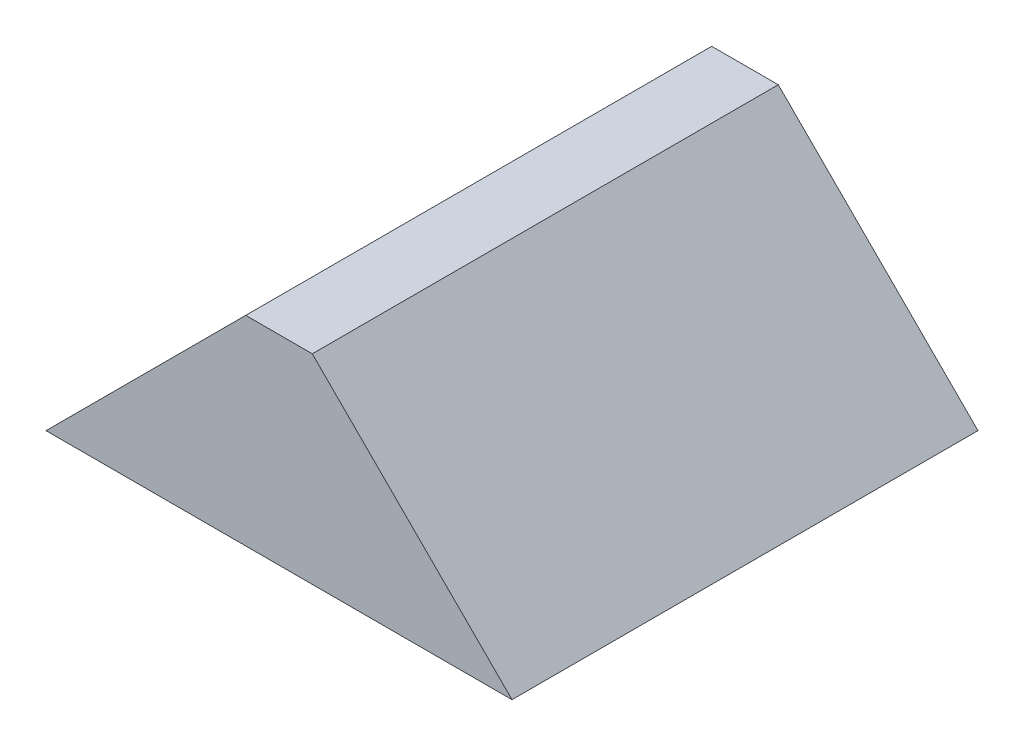
ISO-10303-21;
HEADER;
FILE_DESCRIPTION(('STEP AP214'),'2;1');
FILE_NAME('part.step','',(''),(''),'','','');
FILE_SCHEMA(('AUTOMOTIVE_DESIGN { 1 0 10303 214 1 1 1 1 }'));
ENDSEC;
DATA;
#1=APPLICATION_CONTEXT('core data for automotive mechanical design processes');
#2=APPLICATION_PROTOCOL_DEFINITION('international standard','automotive_design',2000,#1);
#3=PRODUCT_CONTEXT('',#1,'mechanical');
#4=PRODUCT('Part','Part','',(#3));
#5=PRODUCT_RELATED_PRODUCT_CATEGORY('part','',(#4));
#6=PRODUCT_DEFINITION_FORMATION('','',#4);
#7=PRODUCT_DEFINITION_CONTEXT('part definition',#1,'design');
#8=PRODUCT_DEFINITION('design','',#6,#7);
#9=PRODUCT_DEFINITION_SHAPE('','',#8);
#10=(LENGTH_UNIT() NAMED_UNIT(*) SI_UNIT(.MILLI.,.METRE.));
#11=(NAMED_UNIT(*) PLANE_ANGLE_UNIT() SI_UNIT($,.RADIAN.));
#12=(NAMED_UNIT(*) SI_UNIT($,.STERADIAN.) SOLID_ANGLE_UNIT());
#13=UNCERTAINTY_MEASURE_WITH_UNIT(LENGTH_MEASURE(1.E-05),#10,'distance_accuracy_value','');
#14=(GEOMETRIC_REPRESENTATION_CONTEXT(3) GLOBAL_UNCERTAINTY_ASSIGNED_CONTEXT((#13)) GLOBAL_UNIT_ASSIGNED_CONTEXT((#10,
#11,#12)) REPRESENTATION_CONTEXT('',''));
#15=CARTESIAN_POINT('',(0.,0.,0.));
#16=DIRECTION('',(0.,0.,1.));
#17=DIRECTION('',(1.,0.,0.));
#18=AXIS2_PLACEMENT_3D('',#15,#16,#17);
#19=CARTESIAN_POINT('',(0.,38.1,0.));
#20=DIRECTION('',(0.,0.,-1.));
#21=DIRECTION('',(-1.,0.,0.));
#22=AXIS2_PLACEMENT_3D('',#19,#20,#21);
#23=PLANE('',#22);
#24=DIRECTION('',(1.,0.,0.));
#25=VECTOR('',#24,1.);
#26=CARTESIAN_POINT('',(0.,38.1,0.));
#27=LINE('',#26,#25);
#28=CARTESIAN_POINT('',(38.1,38.1,0.));
#29=VERTEX_POINT('',#28);
#30=CARTESIAN_POINT('',(50.8,38.1,0.));
#31=VERTEX_POINT('',#30);
#32=EDGE_CURVE('E47',#29,#31,#27,.T.);
#33=ORIENTED_EDGE('',*,*,#32,.F.);
#34=DIRECTION('',(0.707106781186547,0.707106781186547,0.));
#35=VECTOR('',#34,1.);
#36=CARTESIAN_POINT('',(0.,0.,0.));
#37=LINE('',#36,#35);
#38=CARTESIAN_POINT('',(0.,0.,0.));
#39=VERTEX_POINT('',#38);
#40=EDGE_CURVE('E82',#39,#29,#37,.T.);
#41=ORIENTED_EDGE('',*,*,#40,.F.);
#42=DIRECTION('',(1.,0.,0.));
#43=VECTOR('',#42,1.);
#44=CARTESIAN_POINT('',(0.,0.,0.));
#45=LINE('',#44,#43);
#46=CARTESIAN_POINT('',(88.9,0.,0.));
#47=VERTEX_POINT('',#46);
#48=EDGE_CURVE('E87',#39,#47,#45,.T.);
#49=ORIENTED_EDGE('',*,*,#48,.T.);
#50=DIRECTION('',(0.707106781186548,-0.707106781186547,0.));
#51=VECTOR('',#50,1.);
#52=CARTESIAN_POINT('',(50.8,38.1,0.));
#53=LINE('',#52,#51);
#54=EDGE_CURVE('E63',#31,#47,#53,.T.);
#55=ORIENTED_EDGE('',*,*,#54,.F.);
#56=EDGE_LOOP('',(#33,#41,#49,#55));
#57=FACE_BOUND('',#56,.T.);
#58=ADVANCED_FACE('F39',(#57),#23,.F.);
#59=CARTESIAN_POINT('',(0.,38.1,-88.9));
#60=DIRECTION('',(0.,0.,1.));
#61=DIRECTION('',(1.,0.,0.));
#62=AXIS2_PLACEMENT_3D('',#59,#60,#61);
#63=PLANE('',#62);
#64=DIRECTION('',(-1.,0.,0.));
#65=VECTOR('',#64,1.);
#66=CARTESIAN_POINT('',(0.,0.,-88.9));
#67=LINE('',#66,#65);
#68=CARTESIAN_POINT('',(88.9,0.,-88.9));
#69=VERTEX_POINT('',#68);
#70=CARTESIAN_POINT('',(0.,0.,-88.9));
#71=VERTEX_POINT('',#70);
#72=EDGE_CURVE('E42',#69,#71,#67,.T.);
#73=ORIENTED_EDGE('',*,*,#72,.T.);
#74=DIRECTION('',(0.707106781186547,0.707106781186547,0.));
#75=VECTOR('',#74,1.);
#76=CARTESIAN_POINT('',(0.,0.,-88.9));
#77=LINE('',#76,#75);
#78=CARTESIAN_POINT('',(38.1,38.1,-88.9));
#79=VERTEX_POINT('',#78);
#80=EDGE_CURVE('E55',#71,#79,#77,.T.);
#81=ORIENTED_EDGE('',*,*,#80,.T.);
#82=DIRECTION('',(-1.,0.,0.));
#83=VECTOR('',#82,1.);
#84=CARTESIAN_POINT('',(0.,38.1,-88.9));
#85=LINE('',#84,#83);
#86=CARTESIAN_POINT('',(50.8,38.1,-88.9));
#87=VERTEX_POINT('',#86);
#88=EDGE_CURVE('E11',#87,#79,#85,.T.);
#89=ORIENTED_EDGE('',*,*,#88,.F.);
#90=DIRECTION('',(0.707106781186548,-0.707106781186547,0.));
#91=VECTOR('',#90,1.);
#92=CARTESIAN_POINT('',(50.8,38.1,-88.9));
#93=LINE('',#92,#91);
#94=EDGE_CURVE('E100',#87,#69,#93,.T.);
#95=ORIENTED_EDGE('',*,*,#94,.T.);
#96=EDGE_LOOP('',(#73,#81,#89,#95));
#97=FACE_BOUND('',#96,.T.);
#98=ADVANCED_FACE('F109',(#97),#63,.F.);
#99=CARTESIAN_POINT('',(0.,38.1,0.));
#100=DIRECTION('',(0.,-1.,0.));
#101=DIRECTION('',(0.,0.,-1.));
#102=AXIS2_PLACEMENT_3D('',#99,#100,#101);
#103=PLANE('',#102);
#104=ORIENTED_EDGE('',*,*,#88,.T.);
#105=DIRECTION('',(0.,0.,1.));
#106=VECTOR('',#105,1.);
#107=CARTESIAN_POINT('',(38.1,38.1,-88.9));
#108=LINE('',#107,#106);
#109=EDGE_CURVE('E88',#79,#29,#108,.T.);
#110=ORIENTED_EDGE('',*,*,#109,.T.);
#111=ORIENTED_EDGE('',*,*,#32,.T.);
#112=DIRECTION('',(0.,0.,1.));
#113=VECTOR('',#112,1.);
#114=CARTESIAN_POINT('',(50.8,38.1,-88.9));
#115=LINE('',#114,#113);
#116=EDGE_CURVE('E103',#87,#31,#115,.T.);
#117=ORIENTED_EDGE('',*,*,#116,.F.);
#118=EDGE_LOOP('',(#104,#110,#111,#117));
#119=FACE_BOUND('',#118,.T.);
#120=ADVANCED_FACE('F112',(#119),#103,.F.);
#121=CARTESIAN_POINT('',(0.,0.,0.));
#122=DIRECTION('',(0.,-1.,0.));
#123=DIRECTION('',(0.,0.,-1.));
#124=AXIS2_PLACEMENT_3D('',#121,#122,#123);
#125=PLANE('',#124);
#126=DIRECTION('',(0.,0.,1.));
#127=VECTOR('',#126,1.);
#128=CARTESIAN_POINT('',(0.,0.,0.));
#129=LINE('',#128,#127);
#130=EDGE_CURVE('E79',#71,#39,#129,.T.);
#131=ORIENTED_EDGE('',*,*,#130,.F.);
#132=ORIENTED_EDGE('',*,*,#72,.F.);
#133=DIRECTION('',(0.,0.,-1.));
#134=VECTOR('',#133,1.);
#135=CARTESIAN_POINT('',(88.9,0.,0.));
#136=LINE('',#135,#134);
#137=EDGE_CURVE('E96',#47,#69,#136,.T.);
#138=ORIENTED_EDGE('',*,*,#137,.F.);
#139=ORIENTED_EDGE('',*,*,#48,.F.);
#140=EDGE_LOOP('',(#131,#132,#138,#139));
#141=FACE_BOUND('',#140,.T.);
#142=ADVANCED_FACE('F95',(#141),#125,.T.);
#143=CARTESIAN_POINT('',(50.8,38.1,-88.9));
#144=DIRECTION('',(-0.707106781186547,-0.707106781186548,0.));
#145=DIRECTION('',(0.707106781186548,-0.707106781186547,0.));
#146=AXIS2_PLACEMENT_3D('',#143,#144,#145);
#147=PLANE('',#146);
#148=ORIENTED_EDGE('',*,*,#54,.T.);
#149=ORIENTED_EDGE('',*,*,#137,.T.);
#150=ORIENTED_EDGE('',*,*,#94,.F.);
#151=ORIENTED_EDGE('',*,*,#116,.T.);
#152=EDGE_LOOP('',(#148,#149,#150,#151));
#153=FACE_BOUND('',#152,.T.);
#154=ADVANCED_FACE('F113',(#153),#147,.F.);
#155=CARTESIAN_POINT('',(0.,0.,-88.9));
#156=DIRECTION('',(0.707106781186547,-0.707106781186547,0.));
#157=DIRECTION('',(0.707106781186548,0.707106781186548,0.));
#158=AXIS2_PLACEMENT_3D('',#155,#156,#157);
#159=PLANE('',#158);
#160=ORIENTED_EDGE('',*,*,#40,.T.);
#161=ORIENTED_EDGE('',*,*,#109,.F.);
#162=ORIENTED_EDGE('',*,*,#80,.F.);
#163=ORIENTED_EDGE('',*,*,#130,.T.);
#164=EDGE_LOOP('',(#160,#161,#162,#163));
#165=FACE_BOUND('',#164,.T.);
#166=ADVANCED_FACE('F81',(#165),#159,.F.);
#167=CLOSED_SHELL('',(#58,#98,#120,#142,#154,#166));
#168=MANIFOLD_SOLID_BREP('B2',#167);
#169=ADVANCED_BREP_SHAPE_REPRESENTATION('',(#18,#168),#14);
#170=SHAPE_DEFINITION_REPRESENTATION(#9,#169);
ENDSEC;
END-ISO-10303-21;
